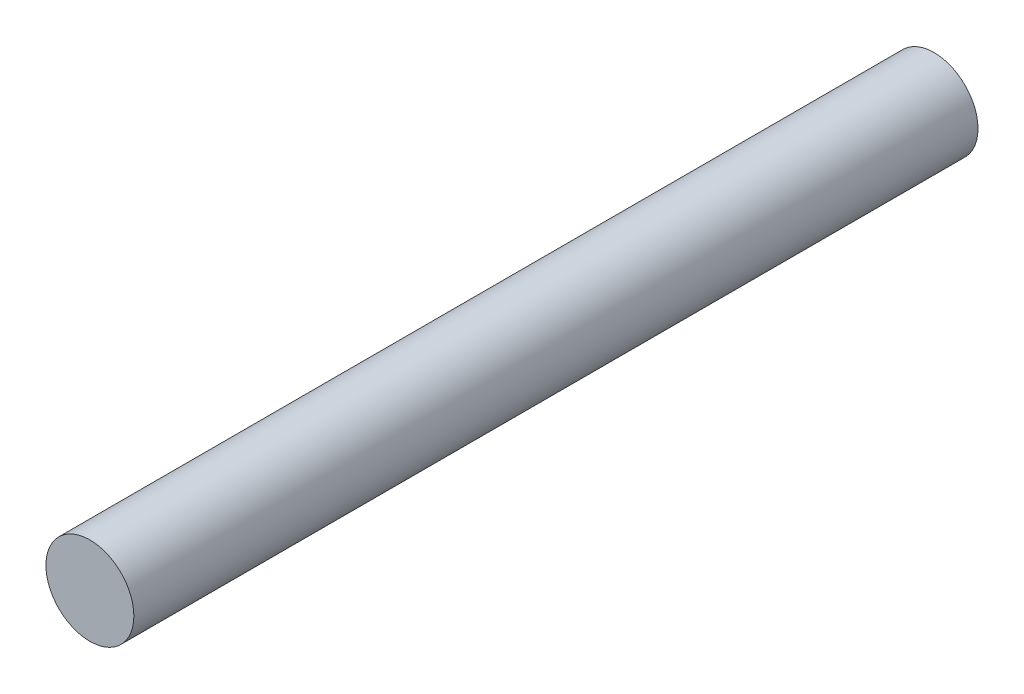
ISO-10303-21;
HEADER;
FILE_DESCRIPTION(('STEP AP214'),'2;1');
FILE_NAME('part.step','',(''),(''),'','','');
FILE_SCHEMA(('AUTOMOTIVE_DESIGN { 1 0 10303 214 1 1 1 1 }'));
ENDSEC;
DATA;
#1=APPLICATION_CONTEXT('core data for automotive mechanical design processes');
#2=APPLICATION_PROTOCOL_DEFINITION('international standard','automotive_design',2000,#1);
#3=PRODUCT_CONTEXT('',#1,'mechanical');
#4=PRODUCT('Part','Part','',(#3));
#5=PRODUCT_RELATED_PRODUCT_CATEGORY('part','',(#4));
#6=PRODUCT_DEFINITION_FORMATION('','',#4);
#7=PRODUCT_DEFINITION_CONTEXT('part definition',#1,'design');
#8=PRODUCT_DEFINITION('design','',#6,#7);
#9=PRODUCT_DEFINITION_SHAPE('','',#8);
#10=(LENGTH_UNIT() NAMED_UNIT(*) SI_UNIT(.MILLI.,.METRE.));
#11=(NAMED_UNIT(*) PLANE_ANGLE_UNIT() SI_UNIT($,.RADIAN.));
#12=(NAMED_UNIT(*) SI_UNIT($,.STERADIAN.) SOLID_ANGLE_UNIT());
#13=UNCERTAINTY_MEASURE_WITH_UNIT(LENGTH_MEASURE(1.E-05),#10,'distance_accuracy_value','');
#14=(GEOMETRIC_REPRESENTATION_CONTEXT(3) GLOBAL_UNCERTAINTY_ASSIGNED_CONTEXT((#13)) GLOBAL_UNIT_ASSIGNED_CONTEXT((#10,
#11,#12)) REPRESENTATION_CONTEXT('',''));
#15=CARTESIAN_POINT('',(0.,0.,0.));
#16=DIRECTION('',(0.,0.,1.));
#17=DIRECTION('',(1.,0.,0.));
#18=AXIS2_PLACEMENT_3D('',#15,#16,#17);
#19=CARTESIAN_POINT('',(0.,0.,38.1));
#20=DIRECTION('',(0.,0.,-1.));
#21=DIRECTION('',(-1.,0.,0.));
#22=AXIS2_PLACEMENT_3D('',#19,#20,#21);
#23=CYLINDRICAL_SURFACE('',#22,1.984375);
#24=CARTESIAN_POINT('',(0.,0.,38.1));
#25=DIRECTION('',(0.,0.,1.));
#26=DIRECTION('',(1.,0.,0.));
#27=AXIS2_PLACEMENT_3D('',#24,#25,#26);
#28=CIRCLE('',#27,1.984375);
#29=CARTESIAN_POINT('',(1.984375,0.,38.1));
#30=VERTEX_POINT('',#29);
#31=EDGE_CURVE('E10',#30,#30,#28,.T.);
#32=ORIENTED_EDGE('',*,*,#31,.F.);
#33=EDGE_LOOP('',(#32));
#34=FACE_BOUND('',#33,.T.);
#35=CARTESIAN_POINT('',(0.,0.,0.));
#36=DIRECTION('',(0.,0.,1.));
#37=DIRECTION('',(1.,0.,0.));
#38=AXIS2_PLACEMENT_3D('',#35,#36,#37);
#39=CIRCLE('',#38,1.984375);
#40=CARTESIAN_POINT('',(1.984375,0.,0.));
#41=VERTEX_POINT('',#40);
#42=EDGE_CURVE('E35',#41,#41,#39,.T.);
#43=ORIENTED_EDGE('',*,*,#42,.T.);
#44=EDGE_LOOP('',(#43));
#45=FACE_BOUND('',#44,.T.);
#46=ADVANCED_FACE('F32',(#34,#45),#23,.T.);
#47=CARTESIAN_POINT('',(0.,0.,38.1));
#48=DIRECTION('',(0.,0.,1.));
#49=DIRECTION('',(1.,0.,0.));
#50=AXIS2_PLACEMENT_3D('',#47,#48,#49);
#51=PLANE('',#50);
#52=ORIENTED_EDGE('',*,*,#31,.T.);
#53=EDGE_LOOP('',(#52));
#54=FACE_BOUND('',#53,.T.);
#55=ADVANCED_FACE('F47',(#54),#51,.T.);
#56=CARTESIAN_POINT('',(0.,0.,0.));
#57=DIRECTION('',(0.,0.,1.));
#58=DIRECTION('',(1.,0.,0.));
#59=AXIS2_PLACEMENT_3D('',#56,#57,#58);
#60=PLANE('',#59);
#61=ORIENTED_EDGE('',*,*,#42,.F.);
#62=EDGE_LOOP('',(#61));
#63=FACE_BOUND('',#62,.T.);
#64=ADVANCED_FACE('F45',(#63),#60,.F.);
#65=CLOSED_SHELL('',(#46,#55,#64));
#66=MANIFOLD_SOLID_BREP('B2',#65);
#67=ADVANCED_BREP_SHAPE_REPRESENTATION('',(#18,#66),#14);
#68=SHAPE_DEFINITION_REPRESENTATION(#9,#67);
ENDSEC;
END-ISO-10303-21;
